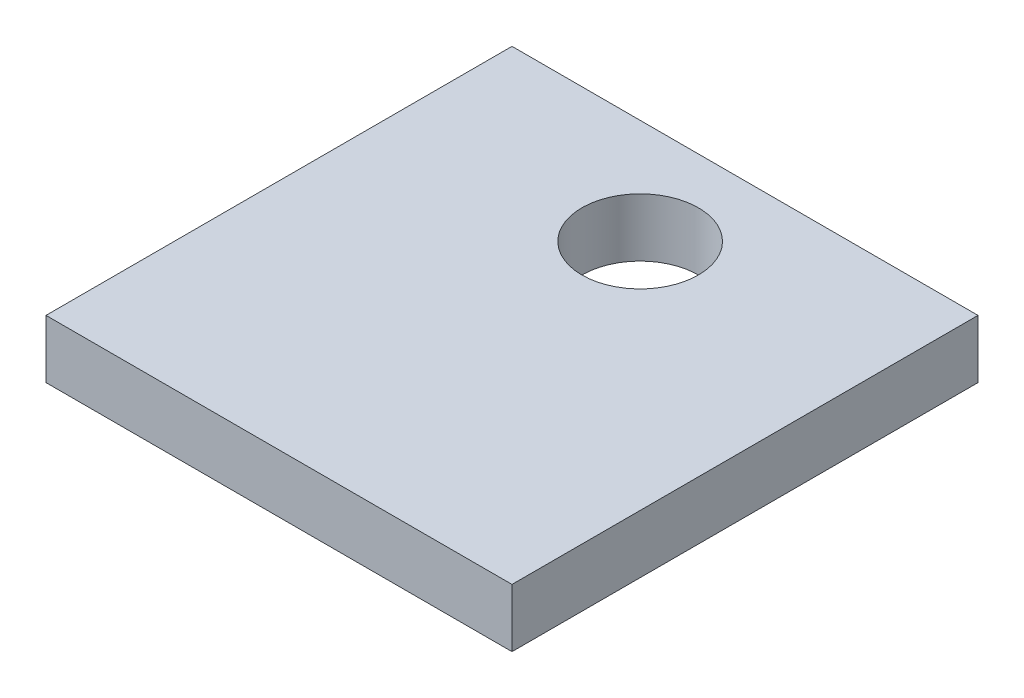
ISO-10303-21;
HEADER;
FILE_DESCRIPTION(('STEP AP214'),'2;1');
FILE_NAME('part.step','',(''),(''),'','','');
FILE_SCHEMA(('AUTOMOTIVE_DESIGN { 1 0 10303 214 1 1 1 1 }'));
ENDSEC;
DATA;
#1=APPLICATION_CONTEXT('core data for automotive mechanical design processes');
#2=APPLICATION_PROTOCOL_DEFINITION('international standard','automotive_design',2000,#1);
#3=PRODUCT_CONTEXT('',#1,'mechanical');
#4=PRODUCT('Part','Part','',(#3));
#5=PRODUCT_RELATED_PRODUCT_CATEGORY('part','',(#4));
#6=PRODUCT_DEFINITION_FORMATION('','',#4);
#7=PRODUCT_DEFINITION_CONTEXT('part definition',#1,'design');
#8=PRODUCT_DEFINITION('design','',#6,#7);
#9=PRODUCT_DEFINITION_SHAPE('','',#8);
#10=(LENGTH_UNIT() NAMED_UNIT(*) SI_UNIT(.MILLI.,.METRE.));
#11=(NAMED_UNIT(*) PLANE_ANGLE_UNIT() SI_UNIT($,.RADIAN.));
#12=(NAMED_UNIT(*) SI_UNIT($,.STERADIAN.) SOLID_ANGLE_UNIT());
#13=UNCERTAINTY_MEASURE_WITH_UNIT(LENGTH_MEASURE(1.E-05),#10,'distance_accuracy_value','');
#14=(GEOMETRIC_REPRESENTATION_CONTEXT(3) GLOBAL_UNCERTAINTY_ASSIGNED_CONTEXT((#13)) GLOBAL_UNIT_ASSIGNED_CONTEXT((#10,
#11,#12)) REPRESENTATION_CONTEXT('',''));
#15=CARTESIAN_POINT('',(0.,0.,0.));
#16=DIRECTION('',(0.,0.,1.));
#17=DIRECTION('',(1.,0.,0.));
#18=AXIS2_PLACEMENT_3D('',#15,#16,#17);
#19=CARTESIAN_POINT('',(-40.,-5.,-40.));
#20=DIRECTION('',(-1.,0.,0.));
#21=DIRECTION('',(0.,0.,1.));
#22=AXIS2_PLACEMENT_3D('',#19,#20,#21);
#23=PLANE('',#22);
#24=DIRECTION('',(0.,0.,1.));
#25=VECTOR('',#24,1.);
#26=CARTESIAN_POINT('',(-40.,5.,-40.));
#27=LINE('',#26,#25);
#28=CARTESIAN_POINT('',(-40.,5.,-40.));
#29=VERTEX_POINT('',#28);
#30=CARTESIAN_POINT('',(-40.,5.,40.));
#31=VERTEX_POINT('',#30);
#32=EDGE_CURVE('E100',#29,#31,#27,.T.);
#33=ORIENTED_EDGE('',*,*,#32,.F.);
#34=DIRECTION('',(0.,1.,0.));
#35=VECTOR('',#34,1.);
#36=CARTESIAN_POINT('',(-40.,-5.,-40.));
#37=LINE('',#36,#35);
#38=CARTESIAN_POINT('',(-40.,-5.,-40.));
#39=VERTEX_POINT('',#38);
#40=EDGE_CURVE('E11',#39,#29,#37,.T.);
#41=ORIENTED_EDGE('',*,*,#40,.F.);
#42=DIRECTION('',(0.,0.,1.));
#43=VECTOR('',#42,1.);
#44=CARTESIAN_POINT('',(-40.,-5.,-40.));
#45=LINE('',#44,#43);
#46=CARTESIAN_POINT('',(-40.,-5.,40.));
#47=VERTEX_POINT('',#46);
#48=EDGE_CURVE('E93',#39,#47,#45,.T.);
#49=ORIENTED_EDGE('',*,*,#48,.T.);
#50=DIRECTION('',(0.,1.,0.));
#51=VECTOR('',#50,1.);
#52=CARTESIAN_POINT('',(-40.,-5.,40.));
#53=LINE('',#52,#51);
#54=EDGE_CURVE('E38',#47,#31,#53,.T.);
#55=ORIENTED_EDGE('',*,*,#54,.T.);
#56=EDGE_LOOP('',(#33,#41,#49,#55));
#57=FACE_BOUND('',#56,.T.);
#58=ADVANCED_FACE('F35',(#57),#23,.T.);
#59=CARTESIAN_POINT('',(40.,-5.,-40.));
#60=DIRECTION('',(0.,0.,-1.));
#61=DIRECTION('',(-1.,0.,0.));
#62=AXIS2_PLACEMENT_3D('',#59,#60,#61);
#63=PLANE('',#62);
#64=DIRECTION('',(-1.,0.,0.));
#65=VECTOR('',#64,1.);
#66=CARTESIAN_POINT('',(40.,5.,-40.));
#67=LINE('',#66,#65);
#68=CARTESIAN_POINT('',(40.,5.,-40.));
#69=VERTEX_POINT('',#68);
#70=EDGE_CURVE('E95',#69,#29,#67,.T.);
#71=ORIENTED_EDGE('',*,*,#70,.F.);
#72=DIRECTION('',(0.,1.,0.));
#73=VECTOR('',#72,1.);
#74=CARTESIAN_POINT('',(40.,-5.,-40.));
#75=LINE('',#74,#73);
#76=CARTESIAN_POINT('',(40.,-5.,-40.));
#77=VERTEX_POINT('',#76);
#78=EDGE_CURVE('E44',#77,#69,#75,.T.);
#79=ORIENTED_EDGE('',*,*,#78,.F.);
#80=DIRECTION('',(-1.,0.,0.));
#81=VECTOR('',#80,1.);
#82=CARTESIAN_POINT('',(40.,-5.,-40.));
#83=LINE('',#82,#81);
#84=EDGE_CURVE('E90',#77,#39,#83,.T.);
#85=ORIENTED_EDGE('',*,*,#84,.T.);
#86=ORIENTED_EDGE('',*,*,#40,.T.);
#87=EDGE_LOOP('',(#71,#79,#85,#86));
#88=FACE_BOUND('',#87,.T.);
#89=ADVANCED_FACE('F111',(#88),#63,.T.);
#90=CARTESIAN_POINT('',(40.,-5.,-40.));
#91=DIRECTION('',(1.,0.,0.));
#92=DIRECTION('',(0.,0.,-1.));
#93=AXIS2_PLACEMENT_3D('',#90,#91,#92);
#94=PLANE('',#93);
#95=DIRECTION('',(0.,0.,-1.));
#96=VECTOR('',#95,1.);
#97=CARTESIAN_POINT('',(40.,5.,-40.));
#98=LINE('',#97,#96);
#99=CARTESIAN_POINT('',(40.,5.,40.));
#100=VERTEX_POINT('',#99);
#101=EDGE_CURVE('E85',#100,#69,#98,.T.);
#102=ORIENTED_EDGE('',*,*,#101,.F.);
#103=DIRECTION('',(0.,1.,0.));
#104=VECTOR('',#103,1.);
#105=CARTESIAN_POINT('',(40.,-5.,40.));
#106=LINE('',#105,#104);
#107=CARTESIAN_POINT('',(40.,-5.,40.));
#108=VERTEX_POINT('',#107);
#109=EDGE_CURVE('E80',#108,#100,#106,.T.);
#110=ORIENTED_EDGE('',*,*,#109,.F.);
#111=DIRECTION('',(0.,0.,-1.));
#112=VECTOR('',#111,1.);
#113=CARTESIAN_POINT('',(40.,-5.,-40.));
#114=LINE('',#113,#112);
#115=EDGE_CURVE('E83',#108,#77,#114,.T.);
#116=ORIENTED_EDGE('',*,*,#115,.T.);
#117=ORIENTED_EDGE('',*,*,#78,.T.);
#118=EDGE_LOOP('',(#102,#110,#116,#117));
#119=FACE_BOUND('',#118,.T.);
#120=ADVANCED_FACE('F82',(#119),#94,.T.);
#121=CARTESIAN_POINT('',(40.,-5.,40.));
#122=DIRECTION('',(0.,0.,1.));
#123=DIRECTION('',(1.,0.,0.));
#124=AXIS2_PLACEMENT_3D('',#121,#122,#123);
#125=PLANE('',#124);
#126=DIRECTION('',(1.,0.,0.));
#127=VECTOR('',#126,1.);
#128=CARTESIAN_POINT('',(40.,5.,40.));
#129=LINE('',#128,#127);
#130=EDGE_CURVE('E103',#31,#100,#129,.T.);
#131=ORIENTED_EDGE('',*,*,#130,.F.);
#132=ORIENTED_EDGE('',*,*,#54,.F.);
#133=DIRECTION('',(1.,0.,0.));
#134=VECTOR('',#133,1.);
#135=CARTESIAN_POINT('',(40.,-5.,40.));
#136=LINE('',#135,#134);
#137=EDGE_CURVE('E89',#47,#108,#136,.T.);
#138=ORIENTED_EDGE('',*,*,#137,.T.);
#139=ORIENTED_EDGE('',*,*,#109,.T.);
#140=EDGE_LOOP('',(#131,#132,#138,#139));
#141=FACE_BOUND('',#140,.T.);
#142=ADVANCED_FACE('F92',(#141),#125,.T.);
#143=CARTESIAN_POINT('',(0.,-5.,0.));
#144=DIRECTION('',(0.,-1.,0.));
#145=DIRECTION('',(0.,0.,-1.));
#146=AXIS2_PLACEMENT_3D('',#143,#144,#145);
#147=PLANE('',#146);
#148=CARTESIAN_POINT('',(0.,-5.,-22.));
#149=DIRECTION('',(0.,1.,0.));
#150=DIRECTION('',(0.,0.,1.));
#151=AXIS2_PLACEMENT_3D('',#148,#149,#150);
#152=CIRCLE('',#151,10.);
#153=CARTESIAN_POINT('',(0.,-5.,-12.));
#154=VERTEX_POINT('',#153);
#155=EDGE_CURVE('E104',#154,#154,#152,.T.);
#156=ORIENTED_EDGE('',*,*,#155,.T.);
#157=EDGE_LOOP('',(#156));
#158=FACE_BOUND('',#157,.T.);
#159=ORIENTED_EDGE('',*,*,#48,.F.);
#160=ORIENTED_EDGE('',*,*,#84,.F.);
#161=ORIENTED_EDGE('',*,*,#115,.F.);
#162=ORIENTED_EDGE('',*,*,#137,.F.);
#163=EDGE_LOOP('',(#159,#160,#161,#162));
#164=FACE_BOUND('',#163,.T.);
#165=ADVANCED_FACE('F88',(#158,#164),#147,.T.);
#166=CARTESIAN_POINT('',(0.,5.,0.));
#167=DIRECTION('',(0.,-1.,0.));
#168=DIRECTION('',(0.,0.,-1.));
#169=AXIS2_PLACEMENT_3D('',#166,#167,#168);
#170=PLANE('',#169);
#171=CARTESIAN_POINT('',(0.,5.,-22.));
#172=DIRECTION('',(0.,1.,0.));
#173=DIRECTION('',(0.,0.,1.));
#174=AXIS2_PLACEMENT_3D('',#171,#172,#173);
#175=CIRCLE('',#174,10.);
#176=CARTESIAN_POINT('',(0.,5.,-12.));
#177=VERTEX_POINT('',#176);
#178=EDGE_CURVE('E141',#177,#177,#175,.T.);
#179=ORIENTED_EDGE('',*,*,#178,.F.);
#180=EDGE_LOOP('',(#179));
#181=FACE_BOUND('',#180,.T.);
#182=ORIENTED_EDGE('',*,*,#32,.T.);
#183=ORIENTED_EDGE('',*,*,#130,.T.);
#184=ORIENTED_EDGE('',*,*,#101,.T.);
#185=ORIENTED_EDGE('',*,*,#70,.T.);
#186=EDGE_LOOP('',(#182,#183,#184,#185));
#187=FACE_BOUND('',#186,.T.);
#188=ADVANCED_FACE('F110',(#181,#187),#170,.F.);
#189=CARTESIAN_POINT('',(0.,-5.,-22.));
#190=DIRECTION('',(0.,1.,0.));
#191=DIRECTION('',(0.,0.,1.));
#192=AXIS2_PLACEMENT_3D('',#189,#190,#191);
#193=CYLINDRICAL_SURFACE('',#192,10.);
#194=ORIENTED_EDGE('',*,*,#155,.F.);
#195=EDGE_LOOP('',(#194));
#196=FACE_BOUND('',#195,.T.);
#197=ORIENTED_EDGE('',*,*,#178,.T.);
#198=EDGE_LOOP('',(#197));
#199=FACE_BOUND('',#198,.T.);
#200=ADVANCED_FACE('F129',(#196,#199),#193,.F.);
#201=CLOSED_SHELL('',(#58,#89,#120,#142,#165,#188,#200));
#202=MANIFOLD_SOLID_BREP('B2',#201);
#203=ADVANCED_BREP_SHAPE_REPRESENTATION('',(#18,#202),#14);
#204=SHAPE_DEFINITION_REPRESENTATION(#9,#203);
ENDSEC;
END-ISO-10303-21;
